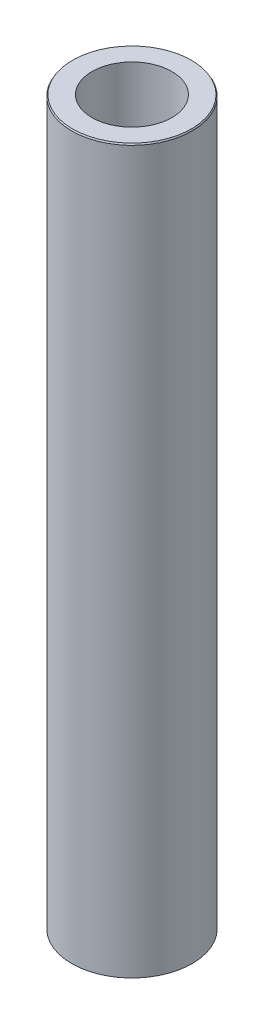
ISO-10303-21;
HEADER;
FILE_DESCRIPTION(('STEP AP214'),'2;1');
FILE_NAME('part.step','',(''),(''),'','','');
FILE_SCHEMA(('AUTOMOTIVE_DESIGN { 1 0 10303 214 1 1 1 1 }'));
ENDSEC;
DATA;
#1=APPLICATION_CONTEXT('core data for automotive mechanical design processes');
#2=APPLICATION_PROTOCOL_DEFINITION('international standard','automotive_design',2000,#1);
#3=PRODUCT_CONTEXT('',#1,'mechanical');
#4=PRODUCT('Part','Part','',(#3));
#5=PRODUCT_RELATED_PRODUCT_CATEGORY('part','',(#4));
#6=PRODUCT_DEFINITION_FORMATION('','',#4);
#7=PRODUCT_DEFINITION_CONTEXT('part definition',#1,'design');
#8=PRODUCT_DEFINITION('design','',#6,#7);
#9=PRODUCT_DEFINITION_SHAPE('','',#8);
#10=(LENGTH_UNIT() NAMED_UNIT(*) SI_UNIT(.MILLI.,.METRE.));
#11=(NAMED_UNIT(*) PLANE_ANGLE_UNIT() SI_UNIT($,.RADIAN.));
#12=(NAMED_UNIT(*) SI_UNIT($,.STERADIAN.) SOLID_ANGLE_UNIT());
#13=UNCERTAINTY_MEASURE_WITH_UNIT(LENGTH_MEASURE(1.E-05),#10,'distance_accuracy_value','');
#14=(GEOMETRIC_REPRESENTATION_CONTEXT(3) GLOBAL_UNCERTAINTY_ASSIGNED_CONTEXT((#13)) GLOBAL_UNIT_ASSIGNED_CONTEXT((#10,
#11,#12)) REPRESENTATION_CONTEXT('',''));
#15=CARTESIAN_POINT('',(0.,0.,0.));
#16=DIRECTION('',(0.,0.,1.));
#17=DIRECTION('',(1.,0.,0.));
#18=AXIS2_PLACEMENT_3D('',#15,#16,#17);
#19=CARTESIAN_POINT('',(0.,600.,0.));
#20=DIRECTION('',(0.,-1.,0.));
#21=DIRECTION('',(0.,0.,-1.));
#22=AXIS2_PLACEMENT_3D('',#19,#20,#21);
#23=CYLINDRICAL_SURFACE('',#22,50.);
#24=CARTESIAN_POINT('',(0.,598.856592231859,0.));
#25=DIRECTION('',(0.,1.,0.));
#26=DIRECTION('',(0.,0.,1.));
#27=AXIS2_PLACEMENT_3D('',#24,#25,#26);
#28=CIRCLE('',#27,50.);
#29=CARTESIAN_POINT('',(0.,598.856592231859,50.));
#30=VERTEX_POINT('',#29);
#31=EDGE_CURVE('E50',#30,#30,#28,.F.);
#32=ORIENTED_EDGE('',*,*,#31,.T.);
#33=EDGE_LOOP('',(#32));
#34=FACE_BOUND('',#33,.T.);
#35=CARTESIAN_POINT('',(0.,0.660146782729742,0.));
#36=DIRECTION('',(0.,1.,0.));
#37=DIRECTION('',(0.,0.,1.));
#38=AXIS2_PLACEMENT_3D('',#35,#36,#37);
#39=CIRCLE('',#38,50.);
#40=CARTESIAN_POINT('',(0.,0.660146782729742,50.));
#41=VERTEX_POINT('',#40);
#42=EDGE_CURVE('E51',#41,#41,#39,.T.);
#43=ORIENTED_EDGE('',*,*,#42,.T.);
#44=EDGE_LOOP('',(#43));
#45=FACE_BOUND('',#44,.T.);
#46=ADVANCED_FACE('F39',(#34,#45),#23,.T.);
#47=CARTESIAN_POINT('',(0.,600.,0.));
#48=DIRECTION('',(0.,1.,0.));
#49=DIRECTION('',(0.,0.,1.));
#50=AXIS2_PLACEMENT_3D('',#47,#48,#49);
#51=PLANE('',#50);
#52=CARTESIAN_POINT('',(0.,600.,0.));
#53=DIRECTION('',(0.,1.,0.));
#54=DIRECTION('',(0.,0.,1.));
#55=AXIS2_PLACEMENT_3D('',#52,#53,#54);
#56=CIRCLE('',#55,49.3398532172701);
#57=CARTESIAN_POINT('',(0.,600.,49.3398532172701));
#58=VERTEX_POINT('',#57);
#59=EDGE_CURVE('E54',#58,#58,#56,.T.);
#60=ORIENTED_EDGE('',*,*,#59,.T.);
#61=EDGE_LOOP('',(#60));
#62=FACE_BOUND('',#61,.T.);
#63=CARTESIAN_POINT('',(0.,600.,0.));
#64=DIRECTION('',(0.,1.,0.));
#65=DIRECTION('',(0.,0.,1.));
#66=AXIS2_PLACEMENT_3D('',#63,#64,#65);
#67=CIRCLE('',#66,33.1479234176682);
#68=CARTESIAN_POINT('',(0.,600.,33.1479234176682));
#69=VERTEX_POINT('',#68);
#70=EDGE_CURVE('E58',#69,#69,#67,.T.);
#71=ORIENTED_EDGE('',*,*,#70,.F.);
#72=EDGE_LOOP('',(#71));
#73=FACE_BOUND('',#72,.T.);
#74=ADVANCED_FACE('F69',(#62,#73),#51,.T.);
#75=CARTESIAN_POINT('',(0.,0.,0.));
#76=DIRECTION('',(0.,1.,0.));
#77=DIRECTION('',(0.,0.,1.));
#78=AXIS2_PLACEMENT_3D('',#75,#76,#77);
#79=PLANE('',#78);
#80=CARTESIAN_POINT('',(0.,0.,0.));
#81=DIRECTION('',(0.,1.,0.));
#82=DIRECTION('',(0.,0.,1.));
#83=AXIS2_PLACEMENT_3D('',#80,#81,#82);
#84=CIRCLE('',#83,48.8565922318588);
#85=CARTESIAN_POINT('',(0.,0.,48.8565922318588));
#86=VERTEX_POINT('',#85);
#87=EDGE_CURVE('E10',#86,#86,#84,.F.);
#88=ORIENTED_EDGE('',*,*,#87,.T.);
#89=EDGE_LOOP('',(#88));
#90=FACE_BOUND('',#89,.T.);
#91=CARTESIAN_POINT('',(0.,0.,0.));
#92=DIRECTION('',(0.,1.,0.));
#93=DIRECTION('',(0.,0.,1.));
#94=AXIS2_PLACEMENT_3D('',#91,#92,#93);
#95=CIRCLE('',#94,33.1479234176682);
#96=CARTESIAN_POINT('',(0.,0.,33.1479234176682));
#97=VERTEX_POINT('',#96);
#98=EDGE_CURVE('E63',#97,#97,#95,.T.);
#99=ORIENTED_EDGE('',*,*,#98,.T.);
#100=EDGE_LOOP('',(#99));
#101=FACE_BOUND('',#100,.T.);
#102=ADVANCED_FACE('F75',(#90,#101),#79,.F.);
#103=CARTESIAN_POINT('',(0.,600.,0.));
#104=DIRECTION('',(0.,-1.,0.));
#105=DIRECTION('',(0.,0.,-1.));
#106=AXIS2_PLACEMENT_3D('',#103,#104,#105);
#107=CYLINDRICAL_SURFACE('',#106,33.1479234176682);
#108=ORIENTED_EDGE('',*,*,#70,.T.);
#109=EDGE_LOOP('',(#108));
#110=FACE_BOUND('',#109,.T.);
#111=ORIENTED_EDGE('',*,*,#98,.F.);
#112=EDGE_LOOP('',(#111));
#113=FACE_BOUND('',#112,.T.);
#114=ADVANCED_FACE('F70',(#110,#113),#107,.F.);
#115=CARTESIAN_POINT('',(0.,600.,0.));
#116=DIRECTION('',(0.,-1.,0.));
#117=DIRECTION('',(0.,0.,-1.));
#118=AXIS2_PLACEMENT_3D('',#115,#116,#117);
#119=CONICAL_SURFACE('',#118,49.3398532172701,0.523598775598337);
#120=ORIENTED_EDGE('',*,*,#31,.F.);
#121=EDGE_LOOP('',(#120));
#122=FACE_BOUND('',#121,.T.);
#123=ORIENTED_EDGE('',*,*,#59,.F.);
#124=EDGE_LOOP('',(#123));
#125=FACE_BOUND('',#124,.T.);
#126=ADVANCED_FACE('F81',(#122,#125),#119,.T.);
#127=CARTESIAN_POINT('',(0.,0.660146782729742,0.));
#128=DIRECTION('',(0.,1.,0.));
#129=DIRECTION('',(0.,0.,1.));
#130=AXIS2_PLACEMENT_3D('',#127,#128,#129);
#131=CONICAL_SURFACE('',#130,50.,1.04719755119664);
#132=ORIENTED_EDGE('',*,*,#87,.F.);
#133=EDGE_LOOP('',(#132));
#134=FACE_BOUND('',#133,.T.);
#135=ORIENTED_EDGE('',*,*,#42,.F.);
#136=EDGE_LOOP('',(#135));
#137=FACE_BOUND('',#136,.T.);
#138=ADVANCED_FACE('F45',(#134,#137),#131,.T.);
#139=CLOSED_SHELL('',(#46,#74,#102,#114,#126,#138));
#140=MANIFOLD_SOLID_BREP('B2',#139);
#141=ADVANCED_BREP_SHAPE_REPRESENTATION('',(#18,#140),#14);
#142=SHAPE_DEFINITION_REPRESENTATION(#9,#141);
ENDSEC;
END-ISO-10303-21;
